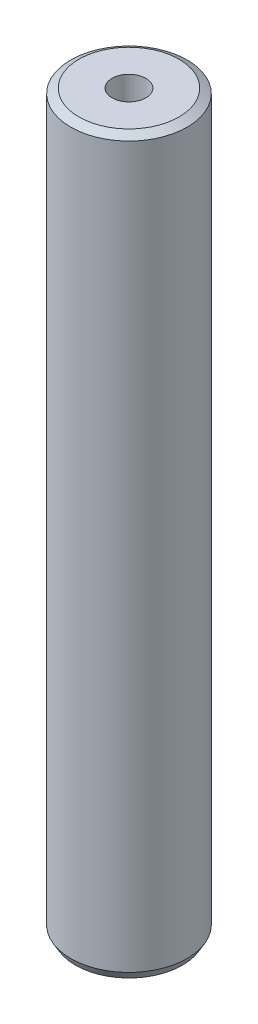
ISO-10303-21;
HEADER;
FILE_DESCRIPTION(('STEP AP214'),'2;1');
FILE_NAME('part.step','',(''),(''),'','','');
FILE_SCHEMA(('AUTOMOTIVE_DESIGN { 1 0 10303 214 1 1 1 1 }'));
ENDSEC;
DATA;
#1=APPLICATION_CONTEXT('core data for automotive mechanical design processes');
#2=APPLICATION_PROTOCOL_DEFINITION('international standard','automotive_design',2000,#1);
#3=PRODUCT_CONTEXT('',#1,'mechanical');
#4=PRODUCT('Part','Part','',(#3));
#5=PRODUCT_RELATED_PRODUCT_CATEGORY('part','',(#4));
#6=PRODUCT_DEFINITION_FORMATION('','',#4);
#7=PRODUCT_DEFINITION_CONTEXT('part definition',#1,'design');
#8=PRODUCT_DEFINITION('design','',#6,#7);
#9=PRODUCT_DEFINITION_SHAPE('','',#8);
#10=(LENGTH_UNIT() NAMED_UNIT(*) SI_UNIT(.MILLI.,.METRE.));
#11=(NAMED_UNIT(*) PLANE_ANGLE_UNIT() SI_UNIT($,.RADIAN.));
#12=(NAMED_UNIT(*) SI_UNIT($,.STERADIAN.) SOLID_ANGLE_UNIT());
#13=UNCERTAINTY_MEASURE_WITH_UNIT(LENGTH_MEASURE(1.E-05),#10,'distance_accuracy_value','');
#14=(GEOMETRIC_REPRESENTATION_CONTEXT(3) GLOBAL_UNCERTAINTY_ASSIGNED_CONTEXT((#13)) GLOBAL_UNIT_ASSIGNED_CONTEXT((#10,
#11,#12)) REPRESENTATION_CONTEXT('',''));
#15=CARTESIAN_POINT('',(0.,0.,0.));
#16=DIRECTION('',(0.,0.,1.));
#17=DIRECTION('',(1.,0.,0.));
#18=AXIS2_PLACEMENT_3D('',#15,#16,#17);
#19=CARTESIAN_POINT('',(0.,440.480492630673,0.));
#20=DIRECTION('',(0.,-1.,0.));
#21=DIRECTION('',(0.,0.,-1.));
#22=AXIS2_PLACEMENT_3D('',#19,#20,#21);
#23=CYLINDRICAL_SURFACE('',#22,35.);
#24=CARTESIAN_POINT('',(0.,437.642733669817,0.));
#25=DIRECTION('',(0.,1.,0.));
#26=DIRECTION('',(0.,0.,1.));
#27=AXIS2_PLACEMENT_3D('',#24,#25,#26);
#28=CIRCLE('',#27,35.);
#29=CARTESIAN_POINT('',(0.,437.642733669817,35.));
#30=VERTEX_POINT('',#29);
#31=EDGE_CURVE('E50',#30,#30,#28,.F.);
#32=ORIENTED_EDGE('',*,*,#31,.T.);
#33=EDGE_LOOP('',(#32));
#34=FACE_BOUND('',#33,.T.);
#35=CARTESIAN_POINT('',(0.,4.91514269983723,0.));
#36=DIRECTION('',(0.,1.,0.));
#37=DIRECTION('',(0.,0.,1.));
#38=AXIS2_PLACEMENT_3D('',#35,#36,#37);
#39=CIRCLE('',#38,35.);
#40=CARTESIAN_POINT('',(0.,4.91514269983723,35.));
#41=VERTEX_POINT('',#40);
#42=EDGE_CURVE('E51',#41,#41,#39,.T.);
#43=ORIENTED_EDGE('',*,*,#42,.T.);
#44=EDGE_LOOP('',(#43));
#45=FACE_BOUND('',#44,.T.);
#46=ADVANCED_FACE('F39',(#34,#45),#23,.T.);
#47=CARTESIAN_POINT('',(0.,440.480492630673,0.));
#48=DIRECTION('',(0.,1.,0.));
#49=DIRECTION('',(0.,0.,1.));
#50=AXIS2_PLACEMENT_3D('',#47,#48,#49);
#51=PLANE('',#50);
#52=CARTESIAN_POINT('',(0.,440.480492630673,0.));
#53=DIRECTION('',(0.,1.,0.));
#54=DIRECTION('',(0.,0.,1.));
#55=AXIS2_PLACEMENT_3D('',#52,#53,#54);
#56=CIRCLE('',#55,30.0848573001627);
#57=CARTESIAN_POINT('',(0.,440.480492630673,30.0848573001627));
#58=VERTEX_POINT('',#57);
#59=EDGE_CURVE('E54',#58,#58,#56,.T.);
#60=ORIENTED_EDGE('',*,*,#59,.T.);
#61=EDGE_LOOP('',(#60));
#62=FACE_BOUND('',#61,.T.);
#63=CARTESIAN_POINT('',(0.,440.480492630673,0.));
#64=DIRECTION('',(0.,1.,0.));
#65=DIRECTION('',(0.,0.,1.));
#66=AXIS2_PLACEMENT_3D('',#63,#64,#65);
#67=CIRCLE('',#66,10.1755893709978);
#68=CARTESIAN_POINT('',(0.,440.480492630673,10.1755893709978));
#69=VERTEX_POINT('',#68);
#70=EDGE_CURVE('E58',#69,#69,#67,.T.);
#71=ORIENTED_EDGE('',*,*,#70,.F.);
#72=EDGE_LOOP('',(#71));
#73=FACE_BOUND('',#72,.T.);
#74=ADVANCED_FACE('F69',(#62,#73),#51,.T.);
#75=CARTESIAN_POINT('',(0.,0.,0.));
#76=DIRECTION('',(0.,1.,0.));
#77=DIRECTION('',(0.,0.,1.));
#78=AXIS2_PLACEMENT_3D('',#75,#76,#77);
#79=PLANE('',#78);
#80=CARTESIAN_POINT('',(0.,0.,0.));
#81=DIRECTION('',(0.,1.,0.));
#82=DIRECTION('',(0.,0.,1.));
#83=AXIS2_PLACEMENT_3D('',#80,#81,#82);
#84=CIRCLE('',#83,32.1622410391436);
#85=CARTESIAN_POINT('',(0.,0.,32.1622410391436));
#86=VERTEX_POINT('',#85);
#87=EDGE_CURVE('E10',#86,#86,#84,.F.);
#88=ORIENTED_EDGE('',*,*,#87,.T.);
#89=EDGE_LOOP('',(#88));
#90=FACE_BOUND('',#89,.T.);
#91=CARTESIAN_POINT('',(0.,0.,0.));
#92=DIRECTION('',(0.,1.,0.));
#93=DIRECTION('',(0.,0.,1.));
#94=AXIS2_PLACEMENT_3D('',#91,#92,#93);
#95=CIRCLE('',#94,10.1755893709978);
#96=CARTESIAN_POINT('',(0.,0.,10.1755893709978));
#97=VERTEX_POINT('',#96);
#98=EDGE_CURVE('E63',#97,#97,#95,.T.);
#99=ORIENTED_EDGE('',*,*,#98,.T.);
#100=EDGE_LOOP('',(#99));
#101=FACE_BOUND('',#100,.T.);
#102=ADVANCED_FACE('F75',(#90,#101),#79,.F.);
#103=CARTESIAN_POINT('',(0.,440.480492630673,0.));
#104=DIRECTION('',(0.,-1.,0.));
#105=DIRECTION('',(0.,0.,-1.));
#106=AXIS2_PLACEMENT_3D('',#103,#104,#105);
#107=CYLINDRICAL_SURFACE('',#106,10.1755893709978);
#108=ORIENTED_EDGE('',*,*,#70,.T.);
#109=EDGE_LOOP('',(#108));
#110=FACE_BOUND('',#109,.T.);
#111=ORIENTED_EDGE('',*,*,#98,.F.);
#112=EDGE_LOOP('',(#111));
#113=FACE_BOUND('',#112,.T.);
#114=ADVANCED_FACE('F70',(#110,#113),#107,.F.);
#115=CARTESIAN_POINT('',(0.,440.480492630673,0.));
#116=DIRECTION('',(0.,-1.,0.));
#117=DIRECTION('',(0.,0.,-1.));
#118=AXIS2_PLACEMENT_3D('',#115,#116,#117);
#119=CONICAL_SURFACE('',#118,30.0848573001627,1.04719755119659);
#120=ORIENTED_EDGE('',*,*,#31,.F.);
#121=EDGE_LOOP('',(#120));
#122=FACE_BOUND('',#121,.T.);
#123=ORIENTED_EDGE('',*,*,#59,.F.);
#124=EDGE_LOOP('',(#123));
#125=FACE_BOUND('',#124,.T.);
#126=ADVANCED_FACE('F81',(#122,#125),#119,.T.);
#127=CARTESIAN_POINT('',(0.,4.91514269983723,0.));
#128=DIRECTION('',(0.,1.,0.));
#129=DIRECTION('',(0.,0.,1.));
#130=AXIS2_PLACEMENT_3D('',#127,#128,#129);
#131=CONICAL_SURFACE('',#130,35.,0.523598775598295);
#132=ORIENTED_EDGE('',*,*,#87,.F.);
#133=EDGE_LOOP('',(#132));
#134=FACE_BOUND('',#133,.T.);
#135=ORIENTED_EDGE('',*,*,#42,.F.);
#136=EDGE_LOOP('',(#135));
#137=FACE_BOUND('',#136,.T.);
#138=ADVANCED_FACE('F45',(#134,#137),#131,.T.);
#139=CLOSED_SHELL('',(#46,#74,#102,#114,#126,#138));
#140=MANIFOLD_SOLID_BREP('B2',#139);
#141=ADVANCED_BREP_SHAPE_REPRESENTATION('',(#18,#140),#14);
#142=SHAPE_DEFINITION_REPRESENTATION(#9,#141);
ENDSEC;
END-ISO-10303-21;
